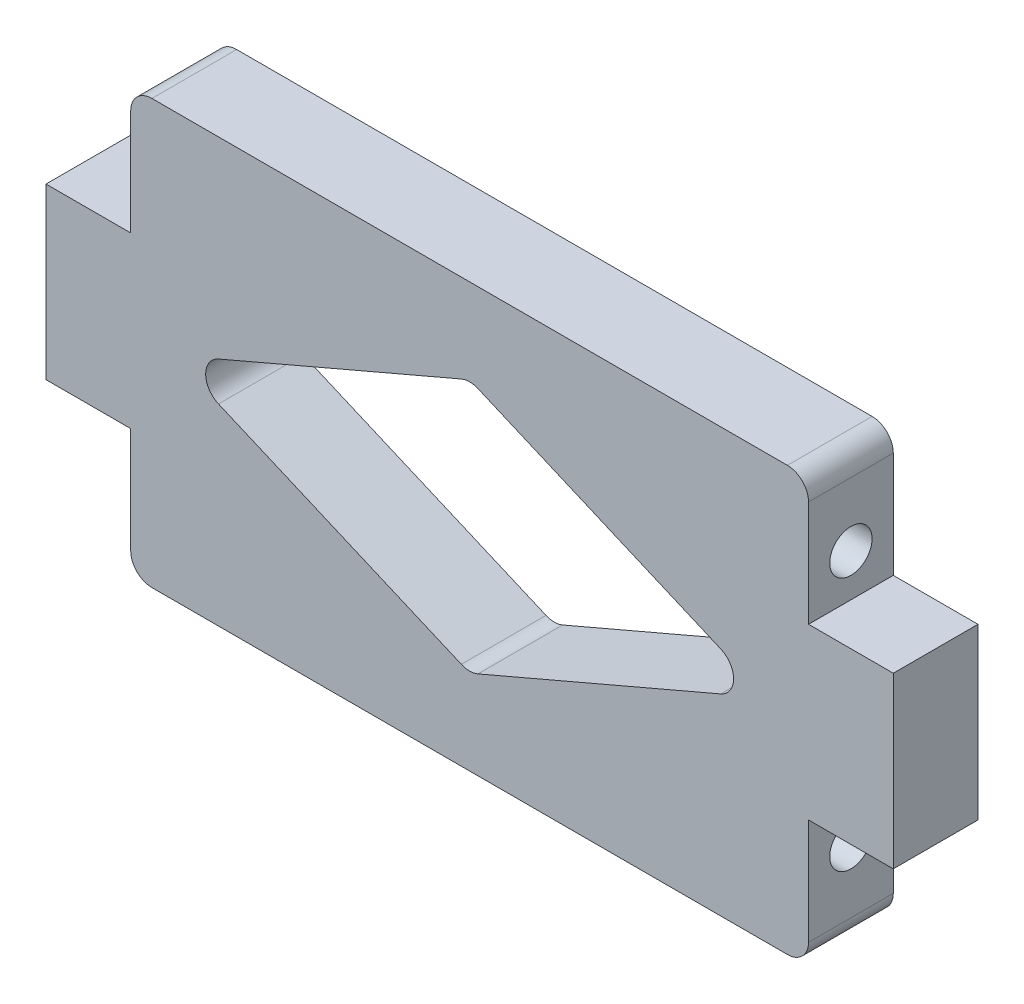
ISO-10303-21;
HEADER;
FILE_DESCRIPTION(('STEP AP214'),'2;1');
FILE_NAME('part.step','',(''),(''),'','','');
FILE_SCHEMA(('AUTOMOTIVE_DESIGN { 1 0 10303 214 1 1 1 1 }'));
ENDSEC;
DATA;
#1=APPLICATION_CONTEXT('core data for automotive mechanical design processes');
#2=APPLICATION_PROTOCOL_DEFINITION('international standard','automotive_design',2000,#1);
#3=PRODUCT_CONTEXT('',#1,'mechanical');
#4=PRODUCT('Part','Part','',(#3));
#5=PRODUCT_RELATED_PRODUCT_CATEGORY('part','',(#4));
#6=PRODUCT_DEFINITION_FORMATION('','',#4);
#7=PRODUCT_DEFINITION_CONTEXT('part definition',#1,'design');
#8=PRODUCT_DEFINITION('design','',#6,#7);
#9=PRODUCT_DEFINITION_SHAPE('','',#8);
#10=(LENGTH_UNIT() NAMED_UNIT(*) SI_UNIT(.MILLI.,.METRE.));
#11=(NAMED_UNIT(*) PLANE_ANGLE_UNIT() SI_UNIT($,.RADIAN.));
#12=(NAMED_UNIT(*) SI_UNIT($,.STERADIAN.) SOLID_ANGLE_UNIT());
#13=UNCERTAINTY_MEASURE_WITH_UNIT(LENGTH_MEASURE(1.E-05),#10,'distance_accuracy_value','');
#14=(GEOMETRIC_REPRESENTATION_CONTEXT(3) GLOBAL_UNCERTAINTY_ASSIGNED_CONTEXT((#13)) GLOBAL_UNIT_ASSIGNED_CONTEXT((#10,
#11,#12)) REPRESENTATION_CONTEXT('',''));
#15=CARTESIAN_POINT('',(0.,0.,0.));
#16=DIRECTION('',(0.,0.,1.));
#17=DIRECTION('',(1.,0.,0.));
#18=AXIS2_PLACEMENT_3D('',#15,#16,#17);
#19=CARTESIAN_POINT('',(-63.5,0.,12.7));
#20=DIRECTION('',(-1.,0.,0.));
#21=DIRECTION('',(0.,0.,1.));
#22=AXIS2_PLACEMENT_3D('',#19,#20,#21);
#23=PLANE('',#22);
#24=DIRECTION('',(0.,1.,0.));
#25=VECTOR('',#24,1.);
#26=CARTESIAN_POINT('',(-63.5,0.,0.));
#27=LINE('',#26,#25);
#28=CARTESIAN_POINT('',(-63.5,-12.7,0.));
#29=VERTEX_POINT('',#28);
#30=CARTESIAN_POINT('',(-63.5,12.7,0.));
#31=VERTEX_POINT('',#30);
#32=EDGE_CURVE('E260',#29,#31,#27,.T.);
#33=ORIENTED_EDGE('',*,*,#32,.F.);
#34=DIRECTION('',(0.,0.,-1.));
#35=VECTOR('',#34,1.);
#36=CARTESIAN_POINT('',(-63.5,-12.7,12.7));
#37=LINE('',#36,#35);
#38=CARTESIAN_POINT('',(-63.5,-12.7,12.7));
#39=VERTEX_POINT('',#38);
#40=EDGE_CURVE('E336',#39,#29,#37,.T.);
#41=ORIENTED_EDGE('',*,*,#40,.F.);
#42=DIRECTION('',(0.,1.,0.));
#43=VECTOR('',#42,1.);
#44=CARTESIAN_POINT('',(-63.5,0.,12.7));
#45=LINE('',#44,#43);
#46=CARTESIAN_POINT('',(-63.5,12.7,12.7));
#47=VERTEX_POINT('',#46);
#48=EDGE_CURVE('E261',#39,#47,#45,.T.);
#49=ORIENTED_EDGE('',*,*,#48,.T.);
#50=DIRECTION('',(0.,0.,-1.));
#51=VECTOR('',#50,1.);
#52=CARTESIAN_POINT('',(-63.5,12.7,12.7));
#53=LINE('',#52,#51);
#54=EDGE_CURVE('E290',#47,#31,#53,.T.);
#55=ORIENTED_EDGE('',*,*,#54,.T.);
#56=EDGE_LOOP('',(#33,#41,#49,#55));
#57=FACE_BOUND('',#56,.T.);
#58=ADVANCED_FACE('F35',(#57),#23,.T.);
#59=CARTESIAN_POINT('',(0.,-12.6999999999999,12.7));
#60=DIRECTION('',(0.,-1.,0.));
#61=DIRECTION('',(1.,0.,0.));
#62=AXIS2_PLACEMENT_3D('',#59,#60,#61);
#63=PLANE('',#62);
#64=DIRECTION('',(-1.,0.,0.));
#65=VECTOR('',#64,1.);
#66=CARTESIAN_POINT('',(0.,-12.6999999999999,0.));
#67=LINE('',#66,#65);
#68=CARTESIAN_POINT('',(-50.8,-12.7,0.));
#69=VERTEX_POINT('',#68);
#70=EDGE_CURVE('E293',#69,#29,#67,.T.);
#71=ORIENTED_EDGE('',*,*,#70,.F.);
#72=DIRECTION('',(0.,0.,-1.));
#73=VECTOR('',#72,1.);
#74=CARTESIAN_POINT('',(-50.8,-12.7,12.7));
#75=LINE('',#74,#73);
#76=CARTESIAN_POINT('',(-50.8,-12.7,12.7));
#77=VERTEX_POINT('',#76);
#78=EDGE_CURVE('E334',#77,#69,#75,.T.);
#79=ORIENTED_EDGE('',*,*,#78,.F.);
#80=DIRECTION('',(-1.,0.,0.));
#81=VECTOR('',#80,1.);
#82=CARTESIAN_POINT('',(0.,-12.6999999999999,12.7));
#83=LINE('',#82,#81);
#84=EDGE_CURVE('E264',#77,#39,#83,.T.);
#85=ORIENTED_EDGE('',*,*,#84,.T.);
#86=ORIENTED_EDGE('',*,*,#40,.T.);
#87=EDGE_LOOP('',(#71,#79,#85,#86));
#88=FACE_BOUND('',#87,.T.);
#89=ADVANCED_FACE('F436',(#88),#63,.T.);
#90=CARTESIAN_POINT('',(-50.8,0.,12.7));
#91=DIRECTION('',(1.,0.,0.));
#92=DIRECTION('',(0.,0.,-1.));
#93=AXIS2_PLACEMENT_3D('',#90,#91,#92);
#94=PLANE('',#93);
#95=CARTESIAN_POINT('',(-50.8,-19.05,6.35));
#96=DIRECTION('',(-1.,0.,0.));
#97=DIRECTION('',(0.,0.,1.));
#98=AXIS2_PLACEMENT_3D('',#95,#96,#97);
#99=CIRCLE('',#98,3.17499999999999);
#100=CARTESIAN_POINT('',(-50.8,-19.05,9.52499999999999));
#101=VERTEX_POINT('',#100);
#102=EDGE_CURVE('E217',#101,#101,#99,.T.);
#103=ORIENTED_EDGE('',*,*,#102,.F.);
#104=EDGE_LOOP('',(#103));
#105=FACE_BOUND('',#104,.T.);
#106=DIRECTION('',(0.,-1.,0.));
#107=VECTOR('',#106,1.);
#108=CARTESIAN_POINT('',(-50.8,0.,0.));
#109=LINE('',#108,#107);
#110=CARTESIAN_POINT('',(-50.8,-28.575,0.));
#111=VERTEX_POINT('',#110);
#112=EDGE_CURVE('E296',#69,#111,#109,.T.);
#113=ORIENTED_EDGE('',*,*,#112,.T.);
#114=DIRECTION('',(0.,0.,-1.));
#115=VECTOR('',#114,1.);
#116=CARTESIAN_POINT('',(-50.8,-28.575,12.7));
#117=LINE('',#116,#115);
#118=CARTESIAN_POINT('',(-50.8,-28.575,12.7));
#119=VERTEX_POINT('',#118);
#120=EDGE_CURVE('E387',#111,#119,#117,.F.);
#121=ORIENTED_EDGE('',*,*,#120,.T.);
#122=DIRECTION('',(0.,-1.,0.));
#123=VECTOR('',#122,1.);
#124=CARTESIAN_POINT('',(-50.8,0.,12.7));
#125=LINE('',#124,#123);
#126=EDGE_CURVE('E268',#77,#119,#125,.T.);
#127=ORIENTED_EDGE('',*,*,#126,.F.);
#128=ORIENTED_EDGE('',*,*,#78,.T.);
#129=EDGE_LOOP('',(#113,#121,#127,#128));
#130=FACE_BOUND('',#129,.T.);
#131=ADVANCED_FACE('F484',(#105,#130),#94,.F.);
#132=CARTESIAN_POINT('',(0.,-31.75,12.7));
#133=DIRECTION('',(0.,1.,0.));
#134=DIRECTION('',(0.,0.,1.));
#135=AXIS2_PLACEMENT_3D('',#132,#133,#134);
#136=PLANE('',#135);
#137=DIRECTION('',(1.,0.,0.));
#138=VECTOR('',#137,1.);
#139=CARTESIAN_POINT('',(0.,-31.75,12.7));
#140=LINE('',#139,#138);
#141=CARTESIAN_POINT('',(-47.625,-31.75,12.7));
#142=VERTEX_POINT('',#141);
#143=CARTESIAN_POINT('',(47.625,-31.75,12.7));
#144=VERTEX_POINT('',#143);
#145=EDGE_CURVE('E271',#142,#144,#140,.T.);
#146=ORIENTED_EDGE('',*,*,#145,.F.);
#147=DIRECTION('',(0.,0.,-1.));
#148=VECTOR('',#147,1.);
#149=CARTESIAN_POINT('',(-47.625,-31.75,12.7));
#150=LINE('',#149,#148);
#151=CARTESIAN_POINT('',(-47.625,-31.75,0.));
#152=VERTEX_POINT('',#151);
#153=EDGE_CURVE('E376',#142,#152,#150,.T.);
#154=ORIENTED_EDGE('',*,*,#153,.T.);
#155=DIRECTION('',(1.,0.,0.));
#156=VECTOR('',#155,1.);
#157=CARTESIAN_POINT('',(0.,-31.75,0.));
#158=LINE('',#157,#156);
#159=CARTESIAN_POINT('',(47.625,-31.75,0.));
#160=VERTEX_POINT('',#159);
#161=EDGE_CURVE('E299',#152,#160,#158,.T.);
#162=ORIENTED_EDGE('',*,*,#161,.T.);
#163=DIRECTION('',(0.,0.,-1.));
#164=VECTOR('',#163,1.);
#165=CARTESIAN_POINT('',(47.625,-31.75,12.7));
#166=LINE('',#165,#164);
#167=EDGE_CURVE('E374',#160,#144,#166,.F.);
#168=ORIENTED_EDGE('',*,*,#167,.T.);
#169=EDGE_LOOP('',(#146,#154,#162,#168));
#170=FACE_BOUND('',#169,.T.);
#171=ADVANCED_FACE('F446',(#170),#136,.F.);
#172=CARTESIAN_POINT('',(50.8,0.,12.7));
#173=DIRECTION('',(1.,0.,0.));
#174=DIRECTION('',(0.,0.,-1.));
#175=AXIS2_PLACEMENT_3D('',#172,#173,#174);
#176=PLANE('',#175);
#177=CARTESIAN_POINT('',(50.8,-19.05,6.35));
#178=DIRECTION('',(1.,0.,0.));
#179=DIRECTION('',(0.,0.,-1.));
#180=AXIS2_PLACEMENT_3D('',#177,#178,#179);
#181=CIRCLE('',#180,3.17499999999999);
#182=CARTESIAN_POINT('',(50.8,-19.05,3.17500000000001));
#183=VERTEX_POINT('',#182);
#184=EDGE_CURVE('E248',#183,#183,#181,.T.);
#185=ORIENTED_EDGE('',*,*,#184,.F.);
#186=EDGE_LOOP('',(#185));
#187=FACE_BOUND('',#186,.T.);
#188=DIRECTION('',(0.,-1.,0.));
#189=VECTOR('',#188,1.);
#190=CARTESIAN_POINT('',(50.8,0.,12.7));
#191=LINE('',#190,#189);
#192=CARTESIAN_POINT('',(50.8,-12.7,12.7));
#193=VERTEX_POINT('',#192);
#194=CARTESIAN_POINT('',(50.8,-28.575,12.7));
#195=VERTEX_POINT('',#194);
#196=EDGE_CURVE('E275',#193,#195,#191,.T.);
#197=ORIENTED_EDGE('',*,*,#196,.T.);
#198=DIRECTION('',(0.,0.,-1.));
#199=VECTOR('',#198,1.);
#200=CARTESIAN_POINT('',(50.8,-28.575,0.));
#201=LINE('',#200,#199);
#202=CARTESIAN_POINT('',(50.8,-28.575,0.));
#203=VERTEX_POINT('',#202);
#204=EDGE_CURVE('E395',#195,#203,#201,.T.);
#205=ORIENTED_EDGE('',*,*,#204,.T.);
#206=DIRECTION('',(0.,-1.,0.));
#207=VECTOR('',#206,1.);
#208=CARTESIAN_POINT('',(50.8,0.,0.));
#209=LINE('',#208,#207);
#210=CARTESIAN_POINT('',(50.8,-12.7,0.));
#211=VERTEX_POINT('',#210);
#212=EDGE_CURVE('E303',#211,#203,#209,.T.);
#213=ORIENTED_EDGE('',*,*,#212,.F.);
#214=DIRECTION('',(0.,0.,-1.));
#215=VECTOR('',#214,1.);
#216=CARTESIAN_POINT('',(50.8,-12.7,12.7));
#217=LINE('',#216,#215);
#218=EDGE_CURVE('E332',#193,#211,#217,.T.);
#219=ORIENTED_EDGE('',*,*,#218,.F.);
#220=EDGE_LOOP('',(#197,#205,#213,#219));
#221=FACE_BOUND('',#220,.T.);
#222=ADVANCED_FACE('F456',(#187,#221),#176,.T.);
#223=CARTESIAN_POINT('',(0.,-12.6999999999999,12.7));
#224=DIRECTION('',(0.,1.,0.));
#225=DIRECTION('',(-1.,0.,0.));
#226=AXIS2_PLACEMENT_3D('',#223,#224,#225);
#227=PLANE('',#226);
#228=DIRECTION('',(1.,0.,0.));
#229=VECTOR('',#228,1.);
#230=CARTESIAN_POINT('',(0.,-12.6999999999999,0.));
#231=LINE('',#230,#229);
#232=CARTESIAN_POINT('',(63.5,-12.7,0.));
#233=VERTEX_POINT('',#232);
#234=EDGE_CURVE('E306',#211,#233,#231,.T.);
#235=ORIENTED_EDGE('',*,*,#234,.T.);
#236=DIRECTION('',(0.,0.,-1.));
#237=VECTOR('',#236,1.);
#238=CARTESIAN_POINT('',(63.5,-12.7,12.7));
#239=LINE('',#238,#237);
#240=CARTESIAN_POINT('',(63.5,-12.7,12.7));
#241=VERTEX_POINT('',#240);
#242=EDGE_CURVE('E329',#241,#233,#239,.T.);
#243=ORIENTED_EDGE('',*,*,#242,.F.);
#244=DIRECTION('',(1.,0.,0.));
#245=VECTOR('',#244,1.);
#246=CARTESIAN_POINT('',(0.,-12.6999999999999,12.7));
#247=LINE('',#246,#245);
#248=EDGE_CURVE('E278',#193,#241,#247,.T.);
#249=ORIENTED_EDGE('',*,*,#248,.F.);
#250=ORIENTED_EDGE('',*,*,#218,.T.);
#251=EDGE_LOOP('',(#235,#243,#249,#250));
#252=FACE_BOUND('',#251,.T.);
#253=ADVANCED_FACE('F463',(#252),#227,.F.);
#254=CARTESIAN_POINT('',(63.5,0.,12.7));
#255=DIRECTION('',(-1.,0.,0.));
#256=DIRECTION('',(0.,0.,1.));
#257=AXIS2_PLACEMENT_3D('',#254,#255,#256);
#258=PLANE('',#257);
#259=DIRECTION('',(0.,1.,0.));
#260=VECTOR('',#259,1.);
#261=CARTESIAN_POINT('',(63.5,0.,0.));
#262=LINE('',#261,#260);
#263=CARTESIAN_POINT('',(63.5,12.7,0.));
#264=VERTEX_POINT('',#263);
#265=EDGE_CURVE('E309',#233,#264,#262,.T.);
#266=ORIENTED_EDGE('',*,*,#265,.T.);
#267=DIRECTION('',(0.,0.,-1.));
#268=VECTOR('',#267,1.);
#269=CARTESIAN_POINT('',(63.5,12.7,12.7));
#270=LINE('',#269,#268);
#271=CARTESIAN_POINT('',(63.5,12.7,12.7));
#272=VERTEX_POINT('',#271);
#273=EDGE_CURVE('E327',#272,#264,#270,.T.);
#274=ORIENTED_EDGE('',*,*,#273,.F.);
#275=DIRECTION('',(0.,1.,0.));
#276=VECTOR('',#275,1.);
#277=CARTESIAN_POINT('',(63.5,0.,12.7));
#278=LINE('',#277,#276);
#279=EDGE_CURVE('E281',#241,#272,#278,.T.);
#280=ORIENTED_EDGE('',*,*,#279,.F.);
#281=ORIENTED_EDGE('',*,*,#242,.T.);
#282=EDGE_LOOP('',(#266,#274,#280,#281));
#283=FACE_BOUND('',#282,.T.);
#284=ADVANCED_FACE('F466',(#283),#258,.F.);
#285=CARTESIAN_POINT('',(0.,12.6999999999999,12.7));
#286=DIRECTION('',(0.,1.,0.));
#287=DIRECTION('',(-1.,0.,0.));
#288=AXIS2_PLACEMENT_3D('',#285,#286,#287);
#289=PLANE('',#288);
#290=DIRECTION('',(1.,0.,0.));
#291=VECTOR('',#290,1.);
#292=CARTESIAN_POINT('',(0.,12.6999999999999,0.));
#293=LINE('',#292,#291);
#294=CARTESIAN_POINT('',(50.8,12.7,0.));
#295=VERTEX_POINT('',#294);
#296=EDGE_CURVE('E312',#295,#264,#293,.T.);
#297=ORIENTED_EDGE('',*,*,#296,.F.);
#298=DIRECTION('',(0.,0.,-1.));
#299=VECTOR('',#298,1.);
#300=CARTESIAN_POINT('',(50.8,12.7,12.7));
#301=LINE('',#300,#299);
#302=CARTESIAN_POINT('',(50.8,12.7,12.7));
#303=VERTEX_POINT('',#302);
#304=EDGE_CURVE('E324',#303,#295,#301,.T.);
#305=ORIENTED_EDGE('',*,*,#304,.F.);
#306=DIRECTION('',(1.,0.,0.));
#307=VECTOR('',#306,1.);
#308=CARTESIAN_POINT('',(0.,12.6999999999999,12.7));
#309=LINE('',#308,#307);
#310=EDGE_CURVE('E283',#303,#272,#309,.T.);
#311=ORIENTED_EDGE('',*,*,#310,.T.);
#312=ORIENTED_EDGE('',*,*,#273,.T.);
#313=EDGE_LOOP('',(#297,#305,#311,#312));
#314=FACE_BOUND('',#313,.T.);
#315=ADVANCED_FACE('F469',(#314),#289,.T.);
#316=CARTESIAN_POINT('',(50.8,19.05,6.35));
#317=DIRECTION('',(1.,0.,0.));
#318=DIRECTION('',(0.,0.,-1.));
#319=AXIS2_PLACEMENT_3D('',#316,#317,#318);
#320=CIRCLE('',#319,3.17499999999999);
#321=CARTESIAN_POINT('',(50.8,19.05,3.17500000000001));
#322=VERTEX_POINT('',#321);
#323=EDGE_CURVE('E236',#322,#322,#320,.T.);
#324=ORIENTED_EDGE('',*,*,#323,.F.);
#325=EDGE_LOOP('',(#324));
#326=FACE_BOUND('',#325,.T.);
#327=CARTESIAN_POINT('',(50.8,28.575,0.));
#328=VERTEX_POINT('',#327);
#329=EDGE_CURVE('E307',#328,#295,#209,.T.);
#330=ORIENTED_EDGE('',*,*,#329,.F.);
#331=DIRECTION('',(0.,0.,-1.));
#332=VECTOR('',#331,1.);
#333=CARTESIAN_POINT('',(50.8,28.575,12.7));
#334=LINE('',#333,#332);
#335=CARTESIAN_POINT('',(50.8,28.575,12.7));
#336=VERTEX_POINT('',#335);
#337=EDGE_CURVE('E43',#328,#336,#334,.F.);
#338=ORIENTED_EDGE('',*,*,#337,.T.);
#339=EDGE_CURVE('E279',#336,#303,#191,.T.);
#340=ORIENTED_EDGE('',*,*,#339,.T.);
#341=ORIENTED_EDGE('',*,*,#304,.T.);
#342=EDGE_LOOP('',(#330,#338,#340,#341));
#343=FACE_BOUND('',#342,.T.);
#344=ADVANCED_FACE('F405',(#326,#343),#176,.T.);
#345=CARTESIAN_POINT('',(0.,31.75,12.7));
#346=DIRECTION('',(0.,1.,0.));
#347=DIRECTION('',(0.,0.,1.));
#348=AXIS2_PLACEMENT_3D('',#345,#346,#347);
#349=PLANE('',#348);
#350=DIRECTION('',(1.,0.,0.));
#351=VECTOR('',#350,1.);
#352=CARTESIAN_POINT('',(0.,31.75,12.7));
#353=LINE('',#352,#351);
#354=CARTESIAN_POINT('',(-47.625,31.75,12.7));
#355=VERTEX_POINT('',#354);
#356=CARTESIAN_POINT('',(47.625,31.75,12.7));
#357=VERTEX_POINT('',#356);
#358=EDGE_CURVE('E286',#355,#357,#353,.T.);
#359=ORIENTED_EDGE('',*,*,#358,.T.);
#360=DIRECTION('',(0.,0.,-1.));
#361=VECTOR('',#360,1.);
#362=CARTESIAN_POINT('',(47.625,31.75,12.7));
#363=LINE('',#362,#361);
#364=CARTESIAN_POINT('',(47.625,31.75,0.));
#365=VERTEX_POINT('',#364);
#366=EDGE_CURVE('E400',#357,#365,#363,.T.);
#367=ORIENTED_EDGE('',*,*,#366,.T.);
#368=DIRECTION('',(1.,0.,0.));
#369=VECTOR('',#368,1.);
#370=CARTESIAN_POINT('',(0.,31.75,0.));
#371=LINE('',#370,#369);
#372=CARTESIAN_POINT('',(-47.625,31.75,0.));
#373=VERTEX_POINT('',#372);
#374=EDGE_CURVE('E315',#373,#365,#371,.T.);
#375=ORIENTED_EDGE('',*,*,#374,.F.);
#376=DIRECTION('',(0.,0.,-1.));
#377=VECTOR('',#376,1.);
#378=CARTESIAN_POINT('',(-47.625,31.75,12.7));
#379=LINE('',#378,#377);
#380=EDGE_CURVE('E398',#373,#355,#379,.F.);
#381=ORIENTED_EDGE('',*,*,#380,.T.);
#382=EDGE_LOOP('',(#359,#367,#375,#381));
#383=FACE_BOUND('',#382,.T.);
#384=ADVANCED_FACE('F414',(#383),#349,.T.);
#385=CARTESIAN_POINT('',(-50.8,19.05,6.35));
#386=DIRECTION('',(-1.,0.,0.));
#387=DIRECTION('',(0.,0.,1.));
#388=AXIS2_PLACEMENT_3D('',#385,#386,#387);
#389=CIRCLE('',#388,3.17499999999999);
#390=CARTESIAN_POINT('',(-50.8,19.05,9.52499999999999));
#391=VERTEX_POINT('',#390);
#392=EDGE_CURVE('E895',#391,#391,#389,.T.);
#393=ORIENTED_EDGE('',*,*,#392,.F.);
#394=EDGE_LOOP('',(#393));
#395=FACE_BOUND('',#394,.T.);
#396=CARTESIAN_POINT('',(-50.8,28.575,12.7));
#397=VERTEX_POINT('',#396);
#398=CARTESIAN_POINT('',(-50.8,12.7,12.7));
#399=VERTEX_POINT('',#398);
#400=EDGE_CURVE('E272',#397,#399,#125,.T.);
#401=ORIENTED_EDGE('',*,*,#400,.F.);
#402=DIRECTION('',(0.,0.,-1.));
#403=VECTOR('',#402,1.);
#404=CARTESIAN_POINT('',(-50.8,28.575,0.));
#405=LINE('',#404,#403);
#406=CARTESIAN_POINT('',(-50.8,28.575,0.));
#407=VERTEX_POINT('',#406);
#408=EDGE_CURVE('E11',#397,#407,#405,.T.);
#409=ORIENTED_EDGE('',*,*,#408,.T.);
#410=CARTESIAN_POINT('',(-50.8,12.7,0.));
#411=VERTEX_POINT('',#410);
#412=EDGE_CURVE('E300',#407,#411,#109,.T.);
#413=ORIENTED_EDGE('',*,*,#412,.T.);
#414=DIRECTION('',(0.,0.,-1.));
#415=VECTOR('',#414,1.);
#416=CARTESIAN_POINT('',(-50.8,12.7,12.7));
#417=LINE('',#416,#415);
#418=EDGE_CURVE('E321',#399,#411,#417,.T.);
#419=ORIENTED_EDGE('',*,*,#418,.F.);
#420=EDGE_LOOP('',(#401,#409,#413,#419));
#421=FACE_BOUND('',#420,.T.);
#422=ADVANCED_FACE('F424',(#395,#421),#94,.F.);
#423=CARTESIAN_POINT('',(0.,12.6999999999999,12.7));
#424=DIRECTION('',(0.,-1.,0.));
#425=DIRECTION('',(1.,0.,0.));
#426=AXIS2_PLACEMENT_3D('',#423,#424,#425);
#427=PLANE('',#426);
#428=DIRECTION('',(-1.,0.,0.));
#429=VECTOR('',#428,1.);
#430=CARTESIAN_POINT('',(0.,12.6999999999999,0.));
#431=LINE('',#430,#429);
#432=EDGE_CURVE('E265',#411,#31,#431,.T.);
#433=ORIENTED_EDGE('',*,*,#432,.T.);
#434=ORIENTED_EDGE('',*,*,#54,.F.);
#435=DIRECTION('',(-1.,0.,0.));
#436=VECTOR('',#435,1.);
#437=CARTESIAN_POINT('',(0.,12.6999999999999,12.7));
#438=LINE('',#437,#436);
#439=EDGE_CURVE('E288',#399,#47,#438,.T.);
#440=ORIENTED_EDGE('',*,*,#439,.F.);
#441=ORIENTED_EDGE('',*,*,#418,.T.);
#442=EDGE_LOOP('',(#433,#434,#440,#441));
#443=FACE_BOUND('',#442,.T.);
#444=ADVANCED_FACE('F431',(#443),#427,.F.);
#445=CARTESIAN_POINT('',(0.,0.,12.7));
#446=DIRECTION('',(0.,0.,1.));
#447=DIRECTION('',(1.,0.,0.));
#448=AXIS2_PLACEMENT_3D('',#445,#446,#447);
#449=PLANE('',#448);
#450=DIRECTION('',(-0.919145030018058,0.393919298579168,0.));
#451=VECTOR('',#450,1.);
#452=CARTESIAN_POINT('',(0.,19.05,12.7));
#453=LINE('',#452,#451);
#454=CARTESIAN_POINT('',(37.6406672359495,2.91828547030734,12.7));
#455=VERTEX_POINT('',#454);
#456=CARTESIAN_POINT('',(1.25069377298886,18.5139883830048,12.7));
#457=VERTEX_POINT('',#456);
#458=EDGE_CURVE('E910',#455,#457,#453,.T.);
#459=ORIENTED_EDGE('',*,*,#458,.F.);
#460=CARTESIAN_POINT('',(36.3899734629607,0.,12.7));
#461=DIRECTION('',(0.,0.,1.));
#462=DIRECTION('',(1.,0.,0.));
#463=AXIS2_PLACEMENT_3D('',#460,#461,#462);
#464=CIRCLE('',#463,3.175);
#465=CARTESIAN_POINT('',(37.6406672359496,-2.91828547030734,12.7));
#466=VERTEX_POINT('',#465);
#467=EDGE_CURVE('E366',#455,#466,#464,.F.);
#468=ORIENTED_EDGE('',*,*,#467,.T.);
#469=DIRECTION('',(0.919145030018058,0.393919298579168,0.));
#470=VECTOR('',#469,1.);
#471=CARTESIAN_POINT('',(44.45,0.,12.7));
#472=LINE('',#471,#470);
#473=CARTESIAN_POINT('',(1.25069377298886,-18.5139883830048,12.7));
#474=VERTEX_POINT('',#473);
#475=EDGE_CURVE('E900',#474,#466,#472,.T.);
#476=ORIENTED_EDGE('',*,*,#475,.F.);
#477=CARTESIAN_POINT('',(0.,-15.5957029126974,12.7));
#478=DIRECTION('',(0.,0.,1.));
#479=DIRECTION('',(1.,0.,0.));
#480=AXIS2_PLACEMENT_3D('',#477,#478,#479);
#481=CIRCLE('',#480,3.175);
#482=CARTESIAN_POINT('',(-1.25069377298885,-18.5139883830048,12.7));
#483=VERTEX_POINT('',#482);
#484=EDGE_CURVE('E358',#474,#483,#481,.F.);
#485=ORIENTED_EDGE('',*,*,#484,.T.);
#486=DIRECTION('',(0.919145030018058,-0.393919298579168,0.));
#487=VECTOR('',#486,1.);
#488=CARTESIAN_POINT('',(0.,-19.05,12.7));
#489=LINE('',#488,#487);
#490=CARTESIAN_POINT('',(-37.6406672359496,-2.91828547030734,12.7));
#491=VERTEX_POINT('',#490);
#492=EDGE_CURVE('E904',#491,#483,#489,.T.);
#493=ORIENTED_EDGE('',*,*,#492,.F.);
#494=CARTESIAN_POINT('',(-36.3899734629607,0.,12.7));
#495=DIRECTION('',(0.,0.,1.));
#496=DIRECTION('',(1.,0.,0.));
#497=AXIS2_PLACEMENT_3D('',#494,#495,#496);
#498=CIRCLE('',#497,3.175);
#499=CARTESIAN_POINT('',(-37.6406672359496,2.91828547030733,12.7));
#500=VERTEX_POINT('',#499);
#501=EDGE_CURVE('E370',#491,#500,#498,.F.);
#502=ORIENTED_EDGE('',*,*,#501,.T.);
#503=DIRECTION('',(-0.919145030018058,-0.393919298579168,0.));
#504=VECTOR('',#503,1.);
#505=CARTESIAN_POINT('',(-44.45,0.,12.7));
#506=LINE('',#505,#504);
#507=CARTESIAN_POINT('',(-1.25069377298886,18.5139883830048,12.7));
#508=VERTEX_POINT('',#507);
#509=EDGE_CURVE('E907',#508,#500,#506,.T.);
#510=ORIENTED_EDGE('',*,*,#509,.F.);
#511=CARTESIAN_POINT('',(0.,15.5957029126974,12.7));
#512=DIRECTION('',(0.,0.,1.));
#513=DIRECTION('',(1.,0.,0.));
#514=AXIS2_PLACEMENT_3D('',#511,#512,#513);
#515=CIRCLE('',#514,3.175);
#516=EDGE_CURVE('E362',#508,#457,#515,.F.);
#517=ORIENTED_EDGE('',*,*,#516,.T.);
#518=EDGE_LOOP('',(#459,#468,#476,#485,#493,#502,#510,#517));
#519=FACE_BOUND('',#518,.T.);
#520=ORIENTED_EDGE('',*,*,#126,.T.);
#521=CARTESIAN_POINT('',(-47.625,-28.575,12.7));
#522=DIRECTION('',(0.,0.,1.));
#523=DIRECTION('',(1.,0.,0.));
#524=AXIS2_PLACEMENT_3D('',#521,#522,#523);
#525=CIRCLE('',#524,3.175);
#526=EDGE_CURVE('E393',#119,#142,#525,.T.);
#527=ORIENTED_EDGE('',*,*,#526,.T.);
#528=ORIENTED_EDGE('',*,*,#145,.T.);
#529=CARTESIAN_POINT('',(47.625,-28.575,12.7));
#530=DIRECTION('',(0.,0.,1.));
#531=DIRECTION('',(1.,0.,0.));
#532=AXIS2_PLACEMENT_3D('',#529,#530,#531);
#533=CIRCLE('',#532,3.175);
#534=EDGE_CURVE('E391',#144,#195,#533,.T.);
#535=ORIENTED_EDGE('',*,*,#534,.T.);
#536=ORIENTED_EDGE('',*,*,#196,.F.);
#537=ORIENTED_EDGE('',*,*,#248,.T.);
#538=ORIENTED_EDGE('',*,*,#279,.T.);
#539=ORIENTED_EDGE('',*,*,#310,.F.);
#540=ORIENTED_EDGE('',*,*,#339,.F.);
#541=CARTESIAN_POINT('',(47.625,28.575,12.7));
#542=DIRECTION('',(0.,0.,1.));
#543=DIRECTION('',(1.,0.,0.));
#544=AXIS2_PLACEMENT_3D('',#541,#542,#543);
#545=CIRCLE('',#544,3.175);
#546=EDGE_CURVE('E56',#336,#357,#545,.T.);
#547=ORIENTED_EDGE('',*,*,#546,.T.);
#548=ORIENTED_EDGE('',*,*,#358,.F.);
#549=CARTESIAN_POINT('',(-47.625,28.575,12.7));
#550=DIRECTION('',(0.,0.,1.));
#551=DIRECTION('',(1.,0.,0.));
#552=AXIS2_PLACEMENT_3D('',#549,#550,#551);
#553=CIRCLE('',#552,3.175);
#554=EDGE_CURVE('E50',#355,#397,#553,.T.);
#555=ORIENTED_EDGE('',*,*,#554,.T.);
#556=ORIENTED_EDGE('',*,*,#400,.T.);
#557=ORIENTED_EDGE('',*,*,#439,.T.);
#558=ORIENTED_EDGE('',*,*,#48,.F.);
#559=ORIENTED_EDGE('',*,*,#84,.F.);
#560=EDGE_LOOP('',(#520,#527,#528,#535,#536,#537,#538,#539,#540,#547,#548,#555,#556,#557,#558,#559));
#561=FACE_BOUND('',#560,.T.);
#562=ADVANCED_FACE('F409',(#519,#561),#449,.T.);
#563=CARTESIAN_POINT('',(0.,0.,0.));
#564=DIRECTION('',(0.,0.,1.));
#565=DIRECTION('',(1.,0.,0.));
#566=AXIS2_PLACEMENT_3D('',#563,#564,#565);
#567=PLANE('',#566);
#568=DIRECTION('',(0.919145030018058,-0.393919298579168,0.));
#569=VECTOR('',#568,1.);
#570=CARTESIAN_POINT('',(0.,-19.05,0.));
#571=LINE('',#570,#569);
#572=CARTESIAN_POINT('',(-37.6406672359496,-2.91828547030734,0.));
#573=VERTEX_POINT('',#572);
#574=CARTESIAN_POINT('',(-1.25069377298885,-18.5139883830048,0.));
#575=VERTEX_POINT('',#574);
#576=EDGE_CURVE('E915',#573,#575,#571,.T.);
#577=ORIENTED_EDGE('',*,*,#576,.T.);
#578=CARTESIAN_POINT('',(0.,-15.5957029126974,0.));
#579=DIRECTION('',(0.,0.,1.));
#580=DIRECTION('',(1.,0.,0.));
#581=AXIS2_PLACEMENT_3D('',#578,#579,#580);
#582=CIRCLE('',#581,3.175);
#583=CARTESIAN_POINT('',(1.25069377298886,-18.5139883830048,0.));
#584=VERTEX_POINT('',#583);
#585=EDGE_CURVE('E360',#575,#584,#582,.T.);
#586=ORIENTED_EDGE('',*,*,#585,.T.);
#587=DIRECTION('',(0.919145030018058,0.393919298579168,0.));
#588=VECTOR('',#587,1.);
#589=CARTESIAN_POINT('',(44.45,0.,0.));
#590=LINE('',#589,#588);
#591=CARTESIAN_POINT('',(37.6406672359496,-2.91828547030734,0.));
#592=VERTEX_POINT('',#591);
#593=EDGE_CURVE('E897',#584,#592,#590,.T.);
#594=ORIENTED_EDGE('',*,*,#593,.T.);
#595=CARTESIAN_POINT('',(36.3899734629607,0.,0.));
#596=DIRECTION('',(0.,0.,1.));
#597=DIRECTION('',(1.,0.,0.));
#598=AXIS2_PLACEMENT_3D('',#595,#596,#597);
#599=CIRCLE('',#598,3.175);
#600=CARTESIAN_POINT('',(37.6406672359495,2.91828547030734,0.));
#601=VERTEX_POINT('',#600);
#602=EDGE_CURVE('E368',#592,#601,#599,.T.);
#603=ORIENTED_EDGE('',*,*,#602,.T.);
#604=DIRECTION('',(-0.919145030018058,0.393919298579168,0.));
#605=VECTOR('',#604,1.);
#606=CARTESIAN_POINT('',(0.,19.05,0.));
#607=LINE('',#606,#605);
#608=CARTESIAN_POINT('',(1.25069377298886,18.5139883830048,0.));
#609=VERTEX_POINT('',#608);
#610=EDGE_CURVE('E903',#601,#609,#607,.T.);
#611=ORIENTED_EDGE('',*,*,#610,.T.);
#612=CARTESIAN_POINT('',(0.,15.5957029126974,0.));
#613=DIRECTION('',(0.,0.,1.));
#614=DIRECTION('',(1.,0.,0.));
#615=AXIS2_PLACEMENT_3D('',#612,#613,#614);
#616=CIRCLE('',#615,3.175);
#617=CARTESIAN_POINT('',(-1.25069377298886,18.5139883830048,0.));
#618=VERTEX_POINT('',#617);
#619=EDGE_CURVE('E364',#609,#618,#616,.T.);
#620=ORIENTED_EDGE('',*,*,#619,.T.);
#621=DIRECTION('',(-0.919145030018058,-0.393919298579168,0.));
#622=VECTOR('',#621,1.);
#623=CARTESIAN_POINT('',(-44.45,0.,0.));
#624=LINE('',#623,#622);
#625=CARTESIAN_POINT('',(-37.6406672359496,2.91828547030733,0.));
#626=VERTEX_POINT('',#625);
#627=EDGE_CURVE('E918',#618,#626,#624,.T.);
#628=ORIENTED_EDGE('',*,*,#627,.T.);
#629=CARTESIAN_POINT('',(-36.3899734629607,0.,0.));
#630=DIRECTION('',(0.,0.,1.));
#631=DIRECTION('',(1.,0.,0.));
#632=AXIS2_PLACEMENT_3D('',#629,#630,#631);
#633=CIRCLE('',#632,3.175);
#634=EDGE_CURVE('E372',#626,#573,#633,.T.);
#635=ORIENTED_EDGE('',*,*,#634,.T.);
#636=EDGE_LOOP('',(#577,#586,#594,#603,#611,#620,#628,#635));
#637=FACE_BOUND('',#636,.T.);
#638=ORIENTED_EDGE('',*,*,#161,.F.);
#639=CARTESIAN_POINT('',(-47.625,-28.575,0.));
#640=DIRECTION('',(0.,0.,1.));
#641=DIRECTION('',(1.,0.,0.));
#642=AXIS2_PLACEMENT_3D('',#639,#640,#641);
#643=CIRCLE('',#642,3.175);
#644=EDGE_CURVE('E385',#152,#111,#643,.F.);
#645=ORIENTED_EDGE('',*,*,#644,.T.);
#646=ORIENTED_EDGE('',*,*,#112,.F.);
#647=ORIENTED_EDGE('',*,*,#70,.T.);
#648=ORIENTED_EDGE('',*,*,#32,.T.);
#649=ORIENTED_EDGE('',*,*,#432,.F.);
#650=ORIENTED_EDGE('',*,*,#412,.F.);
#651=CARTESIAN_POINT('',(-47.625,28.575,0.));
#652=DIRECTION('',(0.,0.,1.));
#653=DIRECTION('',(1.,0.,0.));
#654=AXIS2_PLACEMENT_3D('',#651,#652,#653);
#655=CIRCLE('',#654,3.175);
#656=EDGE_CURVE('E379',#407,#373,#655,.F.);
#657=ORIENTED_EDGE('',*,*,#656,.T.);
#658=ORIENTED_EDGE('',*,*,#374,.T.);
#659=CARTESIAN_POINT('',(47.625,28.575,0.));
#660=DIRECTION('',(0.,0.,1.));
#661=DIRECTION('',(1.,0.,0.));
#662=AXIS2_PLACEMENT_3D('',#659,#660,#661);
#663=CIRCLE('',#662,3.175);
#664=EDGE_CURVE('E381',#365,#328,#663,.F.);
#665=ORIENTED_EDGE('',*,*,#664,.T.);
#666=ORIENTED_EDGE('',*,*,#329,.T.);
#667=ORIENTED_EDGE('',*,*,#296,.T.);
#668=ORIENTED_EDGE('',*,*,#265,.F.);
#669=ORIENTED_EDGE('',*,*,#234,.F.);
#670=ORIENTED_EDGE('',*,*,#212,.T.);
#671=CARTESIAN_POINT('',(47.625,-28.575,0.));
#672=DIRECTION('',(0.,0.,1.));
#673=DIRECTION('',(1.,0.,0.));
#674=AXIS2_PLACEMENT_3D('',#671,#672,#673);
#675=CIRCLE('',#674,3.175);
#676=EDGE_CURVE('E383',#203,#160,#675,.F.);
#677=ORIENTED_EDGE('',*,*,#676,.T.);
#678=EDGE_LOOP('',(#638,#645,#646,#647,#648,#649,#650,#657,#658,#665,#666,#667,#668,#669,#670,#677));
#679=FACE_BOUND('',#678,.T.);
#680=ADVANCED_FACE('F418',(#637,#679),#567,.F.);
#681=CARTESIAN_POINT('',(34.29,-19.05,6.35));
#682=DIRECTION('',(1.,0.,0.));
#683=DIRECTION('',(0.,0.,-1.));
#684=AXIS2_PLACEMENT_3D('',#681,#682,#683);
#685=CONICAL_SURFACE('',#684,2.55269999999999,1.02974425867665);
#686=CARTESIAN_POINT('',(32.7561830978084,-19.05,6.35));
#687=VERTEX_POINT('',#686);
#688=VERTEX_LOOP('',#687);
#689=FACE_BOUND('',#688,.T.);
#690=CARTESIAN_POINT('',(34.29,-19.05,6.35));
#691=DIRECTION('',(1.,0.,0.));
#692=DIRECTION('',(0.,0.,-1.));
#693=AXIS2_PLACEMENT_3D('',#690,#691,#692);
#694=CIRCLE('',#693,2.55269999999999);
#695=CARTESIAN_POINT('',(34.29,-19.05,3.79730000000001));
#696=VERTEX_POINT('',#695);
#697=EDGE_CURVE('E257',#696,#696,#694,.T.);
#698=ORIENTED_EDGE('',*,*,#697,.T.);
#699=EDGE_LOOP('',(#698));
#700=FACE_BOUND('',#699,.T.);
#701=ADVANCED_FACE('F540',(#689,#700),#685,.F.);
#702=CARTESIAN_POINT('',(50.8,-19.05,6.35));
#703=DIRECTION('',(1.,0.,0.));
#704=DIRECTION('',(0.,0.,-1.));
#705=AXIS2_PLACEMENT_3D('',#702,#703,#704);
#706=CYLINDRICAL_SURFACE('',#705,2.55269999999999);
#707=ORIENTED_EDGE('',*,*,#697,.F.);
#708=EDGE_LOOP('',(#707));
#709=FACE_BOUND('',#708,.T.);
#710=CARTESIAN_POINT('',(38.1,-19.05,6.35));
#711=DIRECTION('',(1.,0.,0.));
#712=DIRECTION('',(0.,0.,-1.));
#713=AXIS2_PLACEMENT_3D('',#710,#711,#712);
#714=CIRCLE('',#713,2.55269999999999);
#715=CARTESIAN_POINT('',(38.1,-19.05,3.79730000000001));
#716=VERTEX_POINT('',#715);
#717=EDGE_CURVE('E254',#716,#716,#714,.T.);
#718=ORIENTED_EDGE('',*,*,#717,.T.);
#719=EDGE_LOOP('',(#718));
#720=FACE_BOUND('',#719,.T.);
#721=ADVANCED_FACE('F804',(#709,#720),#706,.F.);
#722=CARTESIAN_POINT('',(38.1,-16.4973,6.35));
#723=DIRECTION('',(-1.,0.,0.));
#724=DIRECTION('',(0.,0.,1.));
#725=AXIS2_PLACEMENT_3D('',#722,#723,#724);
#726=PLANE('',#725);
#727=ORIENTED_EDGE('',*,*,#717,.F.);
#728=EDGE_LOOP('',(#727));
#729=FACE_BOUND('',#728,.T.);
#730=CARTESIAN_POINT('',(38.1,-19.05,6.35));
#731=DIRECTION('',(1.,0.,0.));
#732=DIRECTION('',(0.,0.,-1.));
#733=AXIS2_PLACEMENT_3D('',#730,#731,#732);
#734=CIRCLE('',#733,3.17499999999999);
#735=CARTESIAN_POINT('',(38.1,-19.05,3.17500000000001));
#736=VERTEX_POINT('',#735);
#737=EDGE_CURVE('E251',#736,#736,#734,.T.);
#738=ORIENTED_EDGE('',*,*,#737,.T.);
#739=EDGE_LOOP('',(#738));
#740=FACE_BOUND('',#739,.T.);
#741=ADVANCED_FACE('F794',(#729,#740),#726,.F.);
#742=CARTESIAN_POINT('',(50.8,-19.05,6.35));
#743=DIRECTION('',(1.,0.,0.));
#744=DIRECTION('',(0.,0.,-1.));
#745=AXIS2_PLACEMENT_3D('',#742,#743,#744);
#746=CYLINDRICAL_SURFACE('',#745,3.17499999999999);
#747=ORIENTED_EDGE('',*,*,#737,.F.);
#748=EDGE_LOOP('',(#747));
#749=FACE_BOUND('',#748,.T.);
#750=ORIENTED_EDGE('',*,*,#184,.T.);
#751=EDGE_LOOP('',(#750));
#752=FACE_BOUND('',#751,.T.);
#753=ADVANCED_FACE('F784',(#749,#752),#746,.F.);
#754=CARTESIAN_POINT('',(34.29,19.05,6.35));
#755=DIRECTION('',(1.,0.,0.));
#756=DIRECTION('',(0.,0.,-1.));
#757=AXIS2_PLACEMENT_3D('',#754,#755,#756);
#758=CONICAL_SURFACE('',#757,2.55269999999999,1.02974425867665);
#759=CARTESIAN_POINT('',(32.7561830978084,19.05,6.35));
#760=VERTEX_POINT('',#759);
#761=VERTEX_LOOP('',#760);
#762=FACE_BOUND('',#761,.T.);
#763=CARTESIAN_POINT('',(34.29,19.05,6.35));
#764=DIRECTION('',(1.,0.,0.));
#765=DIRECTION('',(0.,0.,-1.));
#766=AXIS2_PLACEMENT_3D('',#763,#764,#765);
#767=CIRCLE('',#766,2.55269999999999);
#768=CARTESIAN_POINT('',(34.29,19.05,3.79730000000001));
#769=VERTEX_POINT('',#768);
#770=EDGE_CURVE('E245',#769,#769,#767,.T.);
#771=ORIENTED_EDGE('',*,*,#770,.T.);
#772=EDGE_LOOP('',(#771));
#773=FACE_BOUND('',#772,.T.);
#774=ADVANCED_FACE('F774',(#762,#773),#758,.F.);
#775=CARTESIAN_POINT('',(50.8,19.05,6.35));
#776=DIRECTION('',(1.,0.,0.));
#777=DIRECTION('',(0.,0.,-1.));
#778=AXIS2_PLACEMENT_3D('',#775,#776,#777);
#779=CYLINDRICAL_SURFACE('',#778,2.55269999999999);
#780=ORIENTED_EDGE('',*,*,#770,.F.);
#781=EDGE_LOOP('',(#780));
#782=FACE_BOUND('',#781,.T.);
#783=CARTESIAN_POINT('',(38.1,19.05,6.35));
#784=DIRECTION('',(1.,0.,0.));
#785=DIRECTION('',(0.,0.,-1.));
#786=AXIS2_PLACEMENT_3D('',#783,#784,#785);
#787=CIRCLE('',#786,2.55269999999999);
#788=CARTESIAN_POINT('',(38.1,19.05,3.79730000000001));
#789=VERTEX_POINT('',#788);
#790=EDGE_CURVE('E242',#789,#789,#787,.T.);
#791=ORIENTED_EDGE('',*,*,#790,.T.);
#792=EDGE_LOOP('',(#791));
#793=FACE_BOUND('',#792,.T.);
#794=ADVANCED_FACE('F764',(#782,#793),#779,.F.);
#795=CARTESIAN_POINT('',(38.1,21.6027,6.35));
#796=DIRECTION('',(-1.,0.,0.));
#797=DIRECTION('',(0.,0.,1.));
#798=AXIS2_PLACEMENT_3D('',#795,#796,#797);
#799=PLANE('',#798);
#800=ORIENTED_EDGE('',*,*,#790,.F.);
#801=EDGE_LOOP('',(#800));
#802=FACE_BOUND('',#801,.T.);
#803=CARTESIAN_POINT('',(38.1,19.05,6.35));
#804=DIRECTION('',(1.,0.,0.));
#805=DIRECTION('',(0.,0.,-1.));
#806=AXIS2_PLACEMENT_3D('',#803,#804,#805);
#807=CIRCLE('',#806,3.17499999999999);
#808=CARTESIAN_POINT('',(38.1,19.05,3.17500000000001));
#809=VERTEX_POINT('',#808);
#810=EDGE_CURVE('E239',#809,#809,#807,.T.);
#811=ORIENTED_EDGE('',*,*,#810,.T.);
#812=EDGE_LOOP('',(#811));
#813=FACE_BOUND('',#812,.T.);
#814=ADVANCED_FACE('F754',(#802,#813),#799,.F.);
#815=CARTESIAN_POINT('',(50.8,19.05,6.35));
#816=DIRECTION('',(1.,0.,0.));
#817=DIRECTION('',(0.,0.,-1.));
#818=AXIS2_PLACEMENT_3D('',#815,#816,#817);
#819=CYLINDRICAL_SURFACE('',#818,3.17499999999999);
#820=ORIENTED_EDGE('',*,*,#810,.F.);
#821=EDGE_LOOP('',(#820));
#822=FACE_BOUND('',#821,.T.);
#823=ORIENTED_EDGE('',*,*,#323,.T.);
#824=EDGE_LOOP('',(#823));
#825=FACE_BOUND('',#824,.T.);
#826=ADVANCED_FACE('F744',(#822,#825),#819,.F.);
#827=CARTESIAN_POINT('',(-34.29,-19.05,6.35));
#828=DIRECTION('',(-1.,0.,0.));
#829=DIRECTION('',(0.,0.,1.));
#830=AXIS2_PLACEMENT_3D('',#827,#828,#829);
#831=CONICAL_SURFACE('',#830,2.55269999999999,1.02974425867665);
#832=CARTESIAN_POINT('',(-32.7561830978084,-19.05,6.35));
#833=VERTEX_POINT('',#832);
#834=VERTEX_LOOP('',#833);
#835=FACE_BOUND('',#834,.T.);
#836=CARTESIAN_POINT('',(-34.29,-19.05,6.35));
#837=DIRECTION('',(-1.,0.,0.));
#838=DIRECTION('',(0.,0.,1.));
#839=AXIS2_PLACEMENT_3D('',#836,#837,#838);
#840=CIRCLE('',#839,2.55269999999999);
#841=CARTESIAN_POINT('',(-34.29,-19.05,8.90269999999999));
#842=VERTEX_POINT('',#841);
#843=EDGE_CURVE('E233',#842,#842,#840,.T.);
#844=ORIENTED_EDGE('',*,*,#843,.T.);
#845=EDGE_LOOP('',(#844));
#846=FACE_BOUND('',#845,.T.);
#847=ADVANCED_FACE('F734',(#835,#846),#831,.F.);
#848=CARTESIAN_POINT('',(-50.8,-19.05,6.35));
#849=DIRECTION('',(-1.,0.,0.));
#850=DIRECTION('',(0.,0.,1.));
#851=AXIS2_PLACEMENT_3D('',#848,#849,#850);
#852=CYLINDRICAL_SURFACE('',#851,2.55269999999999);
#853=ORIENTED_EDGE('',*,*,#843,.F.);
#854=EDGE_LOOP('',(#853));
#855=FACE_BOUND('',#854,.T.);
#856=CARTESIAN_POINT('',(-38.1,-19.05,6.35));
#857=DIRECTION('',(-1.,0.,0.));
#858=DIRECTION('',(0.,0.,1.));
#859=AXIS2_PLACEMENT_3D('',#856,#857,#858);
#860=CIRCLE('',#859,2.55269999999999);
#861=CARTESIAN_POINT('',(-38.1,-19.05,8.90269999999999));
#862=VERTEX_POINT('',#861);
#863=EDGE_CURVE('E230',#862,#862,#860,.T.);
#864=ORIENTED_EDGE('',*,*,#863,.T.);
#865=EDGE_LOOP('',(#864));
#866=FACE_BOUND('',#865,.T.);
#867=ADVANCED_FACE('F724',(#855,#866),#852,.F.);
#868=CARTESIAN_POINT('',(-38.1,-16.4973,6.35));
#869=DIRECTION('',(1.,0.,0.));
#870=DIRECTION('',(0.,0.,-1.));
#871=AXIS2_PLACEMENT_3D('',#868,#869,#870);
#872=PLANE('',#871);
#873=ORIENTED_EDGE('',*,*,#863,.F.);
#874=EDGE_LOOP('',(#873));
#875=FACE_BOUND('',#874,.T.);
#876=CARTESIAN_POINT('',(-38.1,-19.05,6.35));
#877=DIRECTION('',(-1.,0.,0.));
#878=DIRECTION('',(0.,0.,1.));
#879=AXIS2_PLACEMENT_3D('',#876,#877,#878);
#880=CIRCLE('',#879,3.17499999999999);
#881=CARTESIAN_POINT('',(-38.1,-19.05,9.52499999999999));
#882=VERTEX_POINT('',#881);
#883=EDGE_CURVE('E221',#882,#882,#880,.T.);
#884=ORIENTED_EDGE('',*,*,#883,.T.);
#885=EDGE_LOOP('',(#884));
#886=FACE_BOUND('',#885,.T.);
#887=ADVANCED_FACE('F714',(#875,#886),#872,.F.);
#888=CARTESIAN_POINT('',(-50.8,-19.05,6.35));
#889=DIRECTION('',(-1.,0.,0.));
#890=DIRECTION('',(0.,0.,1.));
#891=AXIS2_PLACEMENT_3D('',#888,#889,#890);
#892=CYLINDRICAL_SURFACE('',#891,3.17499999999999);
#893=ORIENTED_EDGE('',*,*,#883,.F.);
#894=EDGE_LOOP('',(#893));
#895=FACE_BOUND('',#894,.T.);
#896=ORIENTED_EDGE('',*,*,#102,.T.);
#897=EDGE_LOOP('',(#896));
#898=FACE_BOUND('',#897,.T.);
#899=ADVANCED_FACE('F211',(#895,#898),#892,.F.);
#900=CARTESIAN_POINT('',(-34.29,19.05,6.35));
#901=DIRECTION('',(-1.,0.,0.));
#902=DIRECTION('',(0.,0.,1.));
#903=AXIS2_PLACEMENT_3D('',#900,#901,#902);
#904=CONICAL_SURFACE('',#903,2.55269999999999,1.02974425867665);
#905=CARTESIAN_POINT('',(-32.7561830978084,19.05,6.35));
#906=VERTEX_POINT('',#905);
#907=VERTEX_LOOP('',#906);
#908=FACE_BOUND('',#907,.T.);
#909=CARTESIAN_POINT('',(-34.29,19.05,6.35));
#910=DIRECTION('',(-1.,0.,0.));
#911=DIRECTION('',(0.,0.,1.));
#912=AXIS2_PLACEMENT_3D('',#909,#910,#911);
#913=CIRCLE('',#912,2.55269999999999);
#914=CARTESIAN_POINT('',(-34.29,19.05,8.90269999999999));
#915=VERTEX_POINT('',#914);
#916=EDGE_CURVE('E215',#915,#915,#913,.T.);
#917=ORIENTED_EDGE('',*,*,#916,.T.);
#918=EDGE_LOOP('',(#917));
#919=FACE_BOUND('',#918,.T.);
#920=ADVANCED_FACE('F207',(#908,#919),#904,.F.);
#921=CARTESIAN_POINT('',(-50.8,19.05,6.35));
#922=DIRECTION('',(-1.,0.,0.));
#923=DIRECTION('',(0.,0.,1.));
#924=AXIS2_PLACEMENT_3D('',#921,#922,#923);
#925=CYLINDRICAL_SURFACE('',#924,2.55269999999999);
#926=ORIENTED_EDGE('',*,*,#916,.F.);
#927=EDGE_LOOP('',(#926));
#928=FACE_BOUND('',#927,.T.);
#929=CARTESIAN_POINT('',(-38.1,19.05,6.35));
#930=DIRECTION('',(-1.,0.,0.));
#931=DIRECTION('',(0.,0.,1.));
#932=AXIS2_PLACEMENT_3D('',#929,#930,#931);
#933=CIRCLE('',#932,2.55269999999999);
#934=CARTESIAN_POINT('',(-38.1,19.05,8.90269999999999));
#935=VERTEX_POINT('',#934);
#936=EDGE_CURVE('E218',#935,#935,#933,.T.);
#937=ORIENTED_EDGE('',*,*,#936,.T.);
#938=EDGE_LOOP('',(#937));
#939=FACE_BOUND('',#938,.T.);
#940=ADVANCED_FACE('F210',(#928,#939),#925,.F.);
#941=CARTESIAN_POINT('',(-38.1,21.6027,6.35));
#942=DIRECTION('',(1.,0.,0.));
#943=DIRECTION('',(0.,0.,-1.));
#944=AXIS2_PLACEMENT_3D('',#941,#942,#943);
#945=PLANE('',#944);
#946=ORIENTED_EDGE('',*,*,#936,.F.);
#947=EDGE_LOOP('',(#946));
#948=FACE_BOUND('',#947,.T.);
#949=CARTESIAN_POINT('',(-38.1,19.05,6.35));
#950=DIRECTION('',(-1.,0.,0.));
#951=DIRECTION('',(0.,0.,1.));
#952=AXIS2_PLACEMENT_3D('',#949,#950,#951);
#953=CIRCLE('',#952,3.17499999999999);
#954=CARTESIAN_POINT('',(-38.1,19.05,9.52499999999999));
#955=VERTEX_POINT('',#954);
#956=EDGE_CURVE('E224',#955,#955,#953,.T.);
#957=ORIENTED_EDGE('',*,*,#956,.T.);
#958=EDGE_LOOP('',(#957));
#959=FACE_BOUND('',#958,.T.);
#960=ADVANCED_FACE('F681',(#948,#959),#945,.F.);
#961=CARTESIAN_POINT('',(-50.8,19.05,6.35));
#962=DIRECTION('',(-1.,0.,0.));
#963=DIRECTION('',(0.,0.,1.));
#964=AXIS2_PLACEMENT_3D('',#961,#962,#963);
#965=CYLINDRICAL_SURFACE('',#964,3.17499999999999);
#966=ORIENTED_EDGE('',*,*,#956,.F.);
#967=EDGE_LOOP('',(#966));
#968=FACE_BOUND('',#967,.T.);
#969=ORIENTED_EDGE('',*,*,#392,.T.);
#970=EDGE_LOOP('',(#969));
#971=FACE_BOUND('',#970,.T.);
#972=ADVANCED_FACE('F671',(#968,#971),#965,.F.);
#973=CARTESIAN_POINT('',(0.,19.05,0.));
#974=DIRECTION('',(0.393919298579168,0.919145030018058,0.));
#975=DIRECTION('',(-0.919145030018058,0.393919298579168,0.));
#976=AXIS2_PLACEMENT_3D('',#973,#974,#975);
#977=PLANE('',#976);
#978=ORIENTED_EDGE('',*,*,#458,.T.);
#979=DIRECTION('',(0.,0.,1.));
#980=VECTOR('',#979,1.);
#981=CARTESIAN_POINT('',(1.25069377298886,18.5139883830048,0.));
#982=LINE('',#981,#980);
#983=EDGE_CURVE('E356',#457,#609,#982,.F.);
#984=ORIENTED_EDGE('',*,*,#983,.T.);
#985=ORIENTED_EDGE('',*,*,#610,.F.);
#986=DIRECTION('',(0.,0.,1.));
#987=VECTOR('',#986,1.);
#988=CARTESIAN_POINT('',(37.6406672359496,2.91828547030734,12.7));
#989=LINE('',#988,#987);
#990=EDGE_CURVE('E353',#601,#455,#989,.T.);
#991=ORIENTED_EDGE('',*,*,#990,.T.);
#992=EDGE_LOOP('',(#978,#984,#985,#991));
#993=FACE_BOUND('',#992,.T.);
#994=ADVANCED_FACE('F661',(#993),#977,.F.);
#995=CARTESIAN_POINT('',(44.45,0.,0.));
#996=DIRECTION('',(0.393919298579168,-0.919145030018058,0.));
#997=DIRECTION('',(0.919145030018058,0.393919298579168,0.));
#998=AXIS2_PLACEMENT_3D('',#995,#996,#997);
#999=PLANE('',#998);
#1000=ORIENTED_EDGE('',*,*,#593,.F.);
#1001=DIRECTION('',(0.,0.,1.));
#1002=VECTOR('',#1001,1.);
#1003=CARTESIAN_POINT('',(1.25069377298886,-18.5139883830048,12.7));
#1004=LINE('',#1003,#1002);
#1005=EDGE_CURVE('E340',#584,#474,#1004,.T.);
#1006=ORIENTED_EDGE('',*,*,#1005,.T.);
#1007=ORIENTED_EDGE('',*,*,#475,.T.);
#1008=DIRECTION('',(0.,0.,1.));
#1009=VECTOR('',#1008,1.);
#1010=CARTESIAN_POINT('',(37.6406672359496,-2.91828547030734,0.));
#1011=LINE('',#1010,#1009);
#1012=EDGE_CURVE('E338',#466,#592,#1011,.F.);
#1013=ORIENTED_EDGE('',*,*,#1012,.T.);
#1014=EDGE_LOOP('',(#1000,#1006,#1007,#1013));
#1015=FACE_BOUND('',#1014,.T.);
#1016=ADVANCED_FACE('F651',(#1015),#999,.F.);
#1017=CARTESIAN_POINT('',(0.,-19.05,0.));
#1018=DIRECTION('',(-0.393919298579168,-0.919145030018058,0.));
#1019=DIRECTION('',(0.919145030018058,-0.393919298579168,0.));
#1020=AXIS2_PLACEMENT_3D('',#1017,#1018,#1019);
#1021=PLANE('',#1020);
#1022=ORIENTED_EDGE('',*,*,#492,.T.);
#1023=DIRECTION('',(0.,0.,1.));
#1024=VECTOR('',#1023,1.);
#1025=CARTESIAN_POINT('',(-1.25069377298885,-18.5139883830048,0.));
#1026=LINE('',#1025,#1024);
#1027=EDGE_CURVE('E346',#483,#575,#1026,.F.);
#1028=ORIENTED_EDGE('',*,*,#1027,.T.);
#1029=ORIENTED_EDGE('',*,*,#576,.F.);
#1030=DIRECTION('',(0.,0.,1.));
#1031=VECTOR('',#1030,1.);
#1032=CARTESIAN_POINT('',(-37.6406672359496,-2.91828547030734,12.7));
#1033=LINE('',#1032,#1031);
#1034=EDGE_CURVE('E343',#573,#491,#1033,.T.);
#1035=ORIENTED_EDGE('',*,*,#1034,.T.);
#1036=EDGE_LOOP('',(#1022,#1028,#1029,#1035));
#1037=FACE_BOUND('',#1036,.T.);
#1038=ADVANCED_FACE('F641',(#1037),#1021,.F.);
#1039=CARTESIAN_POINT('',(-44.45,0.,0.));
#1040=DIRECTION('',(-0.393919298579168,0.919145030018058,0.));
#1041=DIRECTION('',(-0.919145030018058,-0.393919298579168,0.));
#1042=AXIS2_PLACEMENT_3D('',#1039,#1040,#1041);
#1043=PLANE('',#1042);
#1044=ORIENTED_EDGE('',*,*,#627,.F.);
#1045=DIRECTION('',(0.,0.,1.));
#1046=VECTOR('',#1045,1.);
#1047=CARTESIAN_POINT('',(-1.25069377298886,18.5139883830048,12.7));
#1048=LINE('',#1047,#1046);
#1049=EDGE_CURVE('E350',#618,#508,#1048,.T.);
#1050=ORIENTED_EDGE('',*,*,#1049,.T.);
#1051=ORIENTED_EDGE('',*,*,#509,.T.);
#1052=DIRECTION('',(0.,0.,1.));
#1053=VECTOR('',#1052,1.);
#1054=CARTESIAN_POINT('',(-37.6406672359496,2.91828547030733,0.));
#1055=LINE('',#1054,#1053);
#1056=EDGE_CURVE('E348',#500,#626,#1055,.F.);
#1057=ORIENTED_EDGE('',*,*,#1056,.T.);
#1058=EDGE_LOOP('',(#1044,#1050,#1051,#1057));
#1059=FACE_BOUND('',#1058,.T.);
#1060=ADVANCED_FACE('F492',(#1059),#1043,.F.);
#1061=CARTESIAN_POINT('',(0.,-15.5957029126974,0.));
#1062=DIRECTION('',(0.,0.,-1.));
#1063=DIRECTION('',(-1.,0.,0.));
#1064=AXIS2_PLACEMENT_3D('',#1061,#1062,#1063);
#1065=CYLINDRICAL_SURFACE('',#1064,3.175);
#1066=ORIENTED_EDGE('',*,*,#585,.F.);
#1067=ORIENTED_EDGE('',*,*,#1027,.F.);
#1068=ORIENTED_EDGE('',*,*,#484,.F.);
#1069=ORIENTED_EDGE('',*,*,#1005,.F.);
#1070=EDGE_LOOP('',(#1066,#1067,#1068,#1069));
#1071=FACE_BOUND('',#1070,.T.);
#1072=ADVANCED_FACE('F488',(#1071),#1065,.F.);
#1073=CARTESIAN_POINT('',(0.,15.5957029126974,0.));
#1074=DIRECTION('',(0.,0.,-1.));
#1075=DIRECTION('',(-1.,0.,0.));
#1076=AXIS2_PLACEMENT_3D('',#1073,#1074,#1075);
#1077=CYLINDRICAL_SURFACE('',#1076,3.175);
#1078=ORIENTED_EDGE('',*,*,#619,.F.);
#1079=ORIENTED_EDGE('',*,*,#983,.F.);
#1080=ORIENTED_EDGE('',*,*,#516,.F.);
#1081=ORIENTED_EDGE('',*,*,#1049,.F.);
#1082=EDGE_LOOP('',(#1078,#1079,#1080,#1081));
#1083=FACE_BOUND('',#1082,.T.);
#1084=ADVANCED_FACE('F491',(#1083),#1077,.F.);
#1085=CARTESIAN_POINT('',(36.3899734629607,0.,0.));
#1086=DIRECTION('',(0.,0.,-1.));
#1087=DIRECTION('',(-1.,0.,0.));
#1088=AXIS2_PLACEMENT_3D('',#1085,#1086,#1087);
#1089=CYLINDRICAL_SURFACE('',#1088,3.175);
#1090=ORIENTED_EDGE('',*,*,#602,.F.);
#1091=ORIENTED_EDGE('',*,*,#1012,.F.);
#1092=ORIENTED_EDGE('',*,*,#467,.F.);
#1093=ORIENTED_EDGE('',*,*,#990,.F.);
#1094=EDGE_LOOP('',(#1090,#1091,#1092,#1093));
#1095=FACE_BOUND('',#1094,.T.);
#1096=ADVANCED_FACE('F496',(#1095),#1089,.F.);
#1097=CARTESIAN_POINT('',(-36.3899734629607,0.,0.));
#1098=DIRECTION('',(0.,0.,-1.));
#1099=DIRECTION('',(-1.,0.,0.));
#1100=AXIS2_PLACEMENT_3D('',#1097,#1098,#1099);
#1101=CYLINDRICAL_SURFACE('',#1100,3.175);
#1102=ORIENTED_EDGE('',*,*,#634,.F.);
#1103=ORIENTED_EDGE('',*,*,#1056,.F.);
#1104=ORIENTED_EDGE('',*,*,#501,.F.);
#1105=ORIENTED_EDGE('',*,*,#1034,.F.);
#1106=EDGE_LOOP('',(#1102,#1103,#1104,#1105));
#1107=FACE_BOUND('',#1106,.T.);
#1108=ADVANCED_FACE('F500',(#1107),#1101,.F.);
#1109=CARTESIAN_POINT('',(-47.625,-28.575,12.7));
#1110=DIRECTION('',(0.,0.,-1.));
#1111=DIRECTION('',(-1.,0.,0.));
#1112=AXIS2_PLACEMENT_3D('',#1109,#1110,#1111);
#1113=CYLINDRICAL_SURFACE('',#1112,3.175);
#1114=ORIENTED_EDGE('',*,*,#526,.F.);
#1115=ORIENTED_EDGE('',*,*,#120,.F.);
#1116=ORIENTED_EDGE('',*,*,#644,.F.);
#1117=ORIENTED_EDGE('',*,*,#153,.F.);
#1118=EDGE_LOOP('',(#1114,#1115,#1116,#1117));
#1119=FACE_BOUND('',#1118,.T.);
#1120=ADVANCED_FACE('F444',(#1119),#1113,.T.);
#1121=CARTESIAN_POINT('',(47.625,-28.575,12.7));
#1122=DIRECTION('',(0.,0.,1.));
#1123=DIRECTION('',(1.,0.,0.));
#1124=AXIS2_PLACEMENT_3D('',#1121,#1122,#1123);
#1125=CYLINDRICAL_SURFACE('',#1124,3.175);
#1126=ORIENTED_EDGE('',*,*,#534,.F.);
#1127=ORIENTED_EDGE('',*,*,#167,.F.);
#1128=ORIENTED_EDGE('',*,*,#676,.F.);
#1129=ORIENTED_EDGE('',*,*,#204,.F.);
#1130=EDGE_LOOP('',(#1126,#1127,#1128,#1129));
#1131=FACE_BOUND('',#1130,.T.);
#1132=ADVANCED_FACE('F454',(#1131),#1125,.T.);
#1133=CARTESIAN_POINT('',(47.625,28.575,12.7));
#1134=DIRECTION('',(0.,0.,-1.));
#1135=DIRECTION('',(-1.,0.,0.));
#1136=AXIS2_PLACEMENT_3D('',#1133,#1134,#1135);
#1137=CYLINDRICAL_SURFACE('',#1136,3.175);
#1138=ORIENTED_EDGE('',*,*,#546,.F.);
#1139=ORIENTED_EDGE('',*,*,#337,.F.);
#1140=ORIENTED_EDGE('',*,*,#664,.F.);
#1141=ORIENTED_EDGE('',*,*,#366,.F.);
#1142=EDGE_LOOP('',(#1138,#1139,#1140,#1141));
#1143=FACE_BOUND('',#1142,.T.);
#1144=ADVANCED_FACE('F411',(#1143),#1137,.T.);
#1145=CARTESIAN_POINT('',(-47.625,28.575,12.7));
#1146=DIRECTION('',(0.,0.,1.));
#1147=DIRECTION('',(1.,0.,0.));
#1148=AXIS2_PLACEMENT_3D('',#1145,#1146,#1147);
#1149=CYLINDRICAL_SURFACE('',#1148,3.175);
#1150=ORIENTED_EDGE('',*,*,#554,.F.);
#1151=ORIENTED_EDGE('',*,*,#380,.F.);
#1152=ORIENTED_EDGE('',*,*,#656,.F.);
#1153=ORIENTED_EDGE('',*,*,#408,.F.);
#1154=EDGE_LOOP('',(#1150,#1151,#1152,#1153));
#1155=FACE_BOUND('',#1154,.T.);
#1156=ADVANCED_FACE('F37',(#1155),#1149,.T.);
#1157=CLOSED_SHELL('',(#58,#89,#131,#171,#222,#253,#284,#315,#344,#384,#422,#444,#562,#680,#701,
#721,#741,#753,#774,#794,#814,#826,#847,#867,#887,#899,#920,#940,#960,#972,#994,#1016,#1038,
#1060,#1072,#1084,#1096,#1108,#1120,#1132,#1144,#1156));
#1158=MANIFOLD_SOLID_BREP('B2',#1157);
#1159=ADVANCED_BREP_SHAPE_REPRESENTATION('',(#18,#1158),#14);
#1160=SHAPE_DEFINITION_REPRESENTATION(#9,#1159);
ENDSEC;
END-ISO-10303-21;
